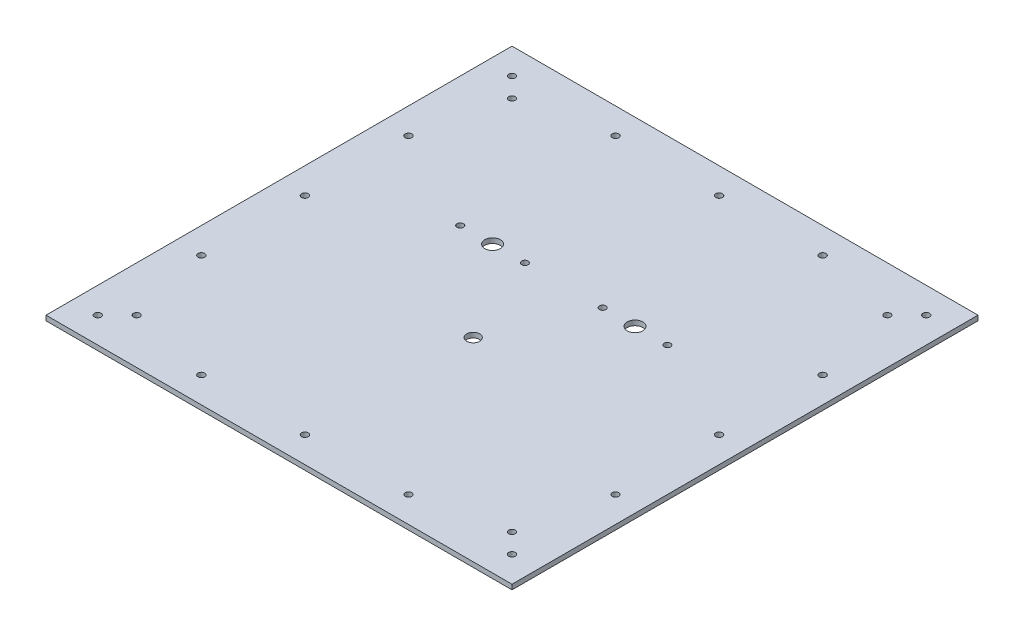
ISO-10303-21;
HEADER;
FILE_DESCRIPTION(('STEP AP214'),'2;1');
FILE_NAME('part.step','',(''),(''),'','','');
FILE_SCHEMA(('AUTOMOTIVE_DESIGN { 1 0 10303 214 1 1 1 1 }'));
ENDSEC;
DATA;
#1=APPLICATION_CONTEXT('core data for automotive mechanical design processes');
#2=APPLICATION_PROTOCOL_DEFINITION('international standard','automotive_design',2000,#1);
#3=PRODUCT_CONTEXT('',#1,'mechanical');
#4=PRODUCT('Part','Part','',(#3));
#5=PRODUCT_RELATED_PRODUCT_CATEGORY('part','',(#4));
#6=PRODUCT_DEFINITION_FORMATION('','',#4);
#7=PRODUCT_DEFINITION_CONTEXT('part definition',#1,'design');
#8=PRODUCT_DEFINITION('design','',#6,#7);
#9=PRODUCT_DEFINITION_SHAPE('','',#8);
#10=(LENGTH_UNIT() NAMED_UNIT(*) SI_UNIT(.MILLI.,.METRE.));
#11=(NAMED_UNIT(*) PLANE_ANGLE_UNIT() SI_UNIT($,.RADIAN.));
#12=(NAMED_UNIT(*) SI_UNIT($,.STERADIAN.) SOLID_ANGLE_UNIT());
#13=UNCERTAINTY_MEASURE_WITH_UNIT(LENGTH_MEASURE(1.E-05),#10,'distance_accuracy_value','');
#14=(GEOMETRIC_REPRESENTATION_CONTEXT(3) GLOBAL_UNCERTAINTY_ASSIGNED_CONTEXT((#13)) GLOBAL_UNIT_ASSIGNED_CONTEXT((#10,
#11,#12)) REPRESENTATION_CONTEXT('',''));
#15=CARTESIAN_POINT('',(0.,0.,0.));
#16=DIRECTION('',(0.,0.,1.));
#17=DIRECTION('',(1.,0.,0.));
#18=AXIS2_PLACEMENT_3D('',#15,#16,#17);
#19=CARTESIAN_POINT('',(228.6,4.826,228.6));
#20=DIRECTION('',(-1.,0.,0.));
#21=DIRECTION('',(0.,0.,1.));
#22=AXIS2_PLACEMENT_3D('',#19,#20,#21);
#23=PLANE('',#22);
#24=DIRECTION('',(0.,0.,-1.));
#25=VECTOR('',#24,1.);
#26=CARTESIAN_POINT('',(228.6,0.,228.6));
#27=LINE('',#26,#25);
#28=CARTESIAN_POINT('',(228.6,0.,228.6));
#29=VERTEX_POINT('',#28);
#30=CARTESIAN_POINT('',(228.6,0.,-228.6));
#31=VERTEX_POINT('',#30);
#32=EDGE_CURVE('E98',#29,#31,#27,.T.);
#33=ORIENTED_EDGE('',*,*,#32,.T.);
#34=DIRECTION('',(0.,-1.,0.));
#35=VECTOR('',#34,1.);
#36=CARTESIAN_POINT('',(228.6,4.826,-228.6));
#37=LINE('',#36,#35);
#38=CARTESIAN_POINT('',(228.6,4.826,-228.6));
#39=VERTEX_POINT('',#38);
#40=EDGE_CURVE('E11',#39,#31,#37,.T.);
#41=ORIENTED_EDGE('',*,*,#40,.F.);
#42=DIRECTION('',(0.,0.,-1.));
#43=VECTOR('',#42,1.);
#44=CARTESIAN_POINT('',(228.6,4.826,228.6));
#45=LINE('',#44,#43);
#46=CARTESIAN_POINT('',(228.6,4.826,228.6));
#47=VERTEX_POINT('',#46);
#48=EDGE_CURVE('E85',#47,#39,#45,.T.);
#49=ORIENTED_EDGE('',*,*,#48,.F.);
#50=DIRECTION('',(0.,-1.,0.));
#51=VECTOR('',#50,1.);
#52=CARTESIAN_POINT('',(228.6,4.826,228.6));
#53=LINE('',#52,#51);
#54=EDGE_CURVE('E94',#47,#29,#53,.T.);
#55=ORIENTED_EDGE('',*,*,#54,.T.);
#56=EDGE_LOOP('',(#33,#41,#49,#55));
#57=FACE_BOUND('',#56,.T.);
#58=ADVANCED_FACE('F32',(#57),#23,.F.);
#59=CARTESIAN_POINT('',(-228.6,4.826,-228.6));
#60=DIRECTION('',(0.,0.,1.));
#61=DIRECTION('',(1.,0.,0.));
#62=AXIS2_PLACEMENT_3D('',#59,#60,#61);
#63=PLANE('',#62);
#64=DIRECTION('',(-1.,0.,0.));
#65=VECTOR('',#64,1.);
#66=CARTESIAN_POINT('',(-228.6,0.,-228.6));
#67=LINE('',#66,#65);
#68=CARTESIAN_POINT('',(-228.6,0.,-228.6));
#69=VERTEX_POINT('',#68);
#70=EDGE_CURVE('E89',#31,#69,#67,.T.);
#71=ORIENTED_EDGE('',*,*,#70,.T.);
#72=DIRECTION('',(0.,-1.,0.));
#73=VECTOR('',#72,1.);
#74=CARTESIAN_POINT('',(-228.6,4.826,-228.6));
#75=LINE('',#74,#73);
#76=CARTESIAN_POINT('',(-228.6,4.826,-228.6));
#77=VERTEX_POINT('',#76);
#78=EDGE_CURVE('E41',#77,#69,#75,.T.);
#79=ORIENTED_EDGE('',*,*,#78,.F.);
#80=DIRECTION('',(-1.,0.,0.));
#81=VECTOR('',#80,1.);
#82=CARTESIAN_POINT('',(-228.6,4.826,-228.6));
#83=LINE('',#82,#81);
#84=EDGE_CURVE('E80',#39,#77,#83,.T.);
#85=ORIENTED_EDGE('',*,*,#84,.F.);
#86=ORIENTED_EDGE('',*,*,#40,.T.);
#87=EDGE_LOOP('',(#71,#79,#85,#86));
#88=FACE_BOUND('',#87,.T.);
#89=ADVANCED_FACE('F88',(#88),#63,.F.);
#90=CARTESIAN_POINT('',(-228.6,4.826,228.6));
#91=DIRECTION('',(1.,0.,0.));
#92=DIRECTION('',(0.,0.,-1.));
#93=AXIS2_PLACEMENT_3D('',#90,#91,#92);
#94=PLANE('',#93);
#95=DIRECTION('',(0.,0.,1.));
#96=VECTOR('',#95,1.);
#97=CARTESIAN_POINT('',(-228.6,0.,228.6));
#98=LINE('',#97,#96);
#99=CARTESIAN_POINT('',(-228.6,0.,228.6));
#100=VERTEX_POINT('',#99);
#101=EDGE_CURVE('E67',#69,#100,#98,.T.);
#102=ORIENTED_EDGE('',*,*,#101,.T.);
#103=DIRECTION('',(0.,-1.,0.));
#104=VECTOR('',#103,1.);
#105=CARTESIAN_POINT('',(-228.6,4.826,228.6));
#106=LINE('',#105,#104);
#107=CARTESIAN_POINT('',(-228.6,4.826,228.6));
#108=VERTEX_POINT('',#107);
#109=EDGE_CURVE('E90',#108,#100,#106,.T.);
#110=ORIENTED_EDGE('',*,*,#109,.F.);
#111=DIRECTION('',(0.,0.,1.));
#112=VECTOR('',#111,1.);
#113=CARTESIAN_POINT('',(-228.6,4.826,228.6));
#114=LINE('',#113,#112);
#115=EDGE_CURVE('E83',#77,#108,#114,.T.);
#116=ORIENTED_EDGE('',*,*,#115,.F.);
#117=ORIENTED_EDGE('',*,*,#78,.T.);
#118=EDGE_LOOP('',(#102,#110,#116,#117));
#119=FACE_BOUND('',#118,.T.);
#120=ADVANCED_FACE('F92',(#119),#94,.F.);
#121=CARTESIAN_POINT('',(-228.6,4.826,228.6));
#122=DIRECTION('',(0.,0.,-1.));
#123=DIRECTION('',(-1.,0.,0.));
#124=AXIS2_PLACEMENT_3D('',#121,#122,#123);
#125=PLANE('',#124);
#126=DIRECTION('',(1.,0.,0.));
#127=VECTOR('',#126,1.);
#128=CARTESIAN_POINT('',(-228.6,0.,228.6));
#129=LINE('',#128,#127);
#130=EDGE_CURVE('E73',#100,#29,#129,.T.);
#131=ORIENTED_EDGE('',*,*,#130,.T.);
#132=ORIENTED_EDGE('',*,*,#54,.F.);
#133=DIRECTION('',(1.,0.,0.));
#134=VECTOR('',#133,1.);
#135=CARTESIAN_POINT('',(-228.6,4.826,228.6));
#136=LINE('',#135,#134);
#137=EDGE_CURVE('E50',#108,#47,#136,.T.);
#138=ORIENTED_EDGE('',*,*,#137,.F.);
#139=ORIENTED_EDGE('',*,*,#109,.T.);
#140=EDGE_LOOP('',(#131,#132,#138,#139));
#141=FACE_BOUND('',#140,.T.);
#142=ADVANCED_FACE('F204',(#141),#125,.F.);
#143=CARTESIAN_POINT('',(0.,4.826,0.));
#144=DIRECTION('',(0.,-1.,0.));
#145=DIRECTION('',(0.,0.,-1.));
#146=AXIS2_PLACEMENT_3D('',#143,#144,#145);
#147=PLANE('',#146);
#148=CARTESIAN_POINT('',(-101.6,4.826,-50.8));
#149=DIRECTION('',(0.,1.,0.));
#150=DIRECTION('',(0.,0.,1.));
#151=AXIS2_PLACEMENT_3D('',#148,#149,#150);
#152=CIRCLE('',#151,3.175);
#153=CARTESIAN_POINT('',(-101.6,4.826,-47.625));
#154=VERTEX_POINT('',#153);
#155=EDGE_CURVE('E519',#154,#154,#152,.T.);
#156=ORIENTED_EDGE('',*,*,#155,.F.);
#157=EDGE_LOOP('',(#156));
#158=FACE_BOUND('',#157,.T.);
#159=CARTESIAN_POINT('',(-38.1,4.826,-50.8));
#160=DIRECTION('',(0.,1.,0.));
#161=DIRECTION('',(0.,0.,1.));
#162=AXIS2_PLACEMENT_3D('',#159,#160,#161);
#163=CIRCLE('',#162,3.175);
#164=CARTESIAN_POINT('',(-38.1,4.826,-47.625));
#165=VERTEX_POINT('',#164);
#166=EDGE_CURVE('E525',#165,#165,#163,.T.);
#167=ORIENTED_EDGE('',*,*,#166,.F.);
#168=EDGE_LOOP('',(#167));
#169=FACE_BOUND('',#168,.T.);
#170=CARTESIAN_POINT('',(38.1,4.826,-50.8));
#171=DIRECTION('',(0.,1.,0.));
#172=DIRECTION('',(0.,0.,1.));
#173=AXIS2_PLACEMENT_3D('',#170,#171,#172);
#174=CIRCLE('',#173,3.175);
#175=CARTESIAN_POINT('',(38.1,4.826,-47.625));
#176=VERTEX_POINT('',#175);
#177=EDGE_CURVE('E533',#176,#176,#174,.T.);
#178=ORIENTED_EDGE('',*,*,#177,.F.);
#179=EDGE_LOOP('',(#178));
#180=FACE_BOUND('',#179,.T.);
#181=CARTESIAN_POINT('',(101.6,4.826,-50.8));
#182=DIRECTION('',(0.,1.,0.));
#183=DIRECTION('',(0.,0.,1.));
#184=AXIS2_PLACEMENT_3D('',#181,#182,#183);
#185=CIRCLE('',#184,3.175);
#186=CARTESIAN_POINT('',(101.6,4.826,-47.625));
#187=VERTEX_POINT('',#186);
#188=EDGE_CURVE('E539',#187,#187,#185,.T.);
#189=ORIENTED_EDGE('',*,*,#188,.F.);
#190=EDGE_LOOP('',(#189));
#191=FACE_BOUND('',#190,.T.);
#192=CARTESIAN_POINT('',(-101.6,4.826,-203.2));
#193=DIRECTION('',(0.,1.,0.));
#194=DIRECTION('',(0.,0.,1.));
#195=AXIS2_PLACEMENT_3D('',#192,#193,#194);
#196=CIRCLE('',#195,3.26389999999998);
#197=CARTESIAN_POINT('',(-101.6,4.826,-199.9361));
#198=VERTEX_POINT('',#197);
#199=EDGE_CURVE('E556',#198,#198,#196,.T.);
#200=ORIENTED_EDGE('',*,*,#199,.F.);
#201=EDGE_LOOP('',(#200));
#202=FACE_BOUND('',#201,.T.);
#203=CARTESIAN_POINT('',(-203.2,4.826,203.200000000003));
#204=DIRECTION('',(0.,1.,0.));
#205=DIRECTION('',(0.,0.,1.));
#206=AXIS2_PLACEMENT_3D('',#203,#204,#205);
#207=CIRCLE('',#206,3.26389999999998);
#208=CARTESIAN_POINT('',(-203.2,4.826,206.463900000003));
#209=VERTEX_POINT('',#208);
#210=EDGE_CURVE('E559',#209,#209,#207,.T.);
#211=ORIENTED_EDGE('',*,*,#210,.F.);
#212=EDGE_LOOP('',(#211));
#213=FACE_BOUND('',#212,.T.);
#214=CARTESIAN_POINT('',(101.6,4.826,-203.2));
#215=DIRECTION('',(0.,1.,0.));
#216=DIRECTION('',(0.,0.,1.));
#217=AXIS2_PLACEMENT_3D('',#214,#215,#216);
#218=CIRCLE('',#217,3.26389999999998);
#219=CARTESIAN_POINT('',(101.6,4.826,-199.9361));
#220=VERTEX_POINT('',#219);
#221=EDGE_CURVE('E550',#220,#220,#218,.T.);
#222=ORIENTED_EDGE('',*,*,#221,.F.);
#223=EDGE_LOOP('',(#222));
#224=FACE_BOUND('',#223,.T.);
#225=CARTESIAN_POINT('',(0.,4.826,-203.2));
#226=DIRECTION('',(0.,1.,0.));
#227=DIRECTION('',(0.,0.,1.));
#228=AXIS2_PLACEMENT_3D('',#225,#226,#227);
#229=CIRCLE('',#228,3.26389999999998);
#230=CARTESIAN_POINT('',(0.,4.826,-199.9361));
#231=VERTEX_POINT('',#230);
#232=EDGE_CURVE('E553',#231,#231,#229,.T.);
#233=ORIENTED_EDGE('',*,*,#232,.F.);
#234=EDGE_LOOP('',(#233));
#235=FACE_BOUND('',#234,.T.);
#236=CARTESIAN_POINT('',(203.199999999999,4.826,-101.6));
#237=DIRECTION('',(0.,1.,0.));
#238=DIRECTION('',(0.,0.,1.));
#239=AXIS2_PLACEMENT_3D('',#236,#237,#238);
#240=CIRCLE('',#239,3.26389999999998);
#241=CARTESIAN_POINT('',(203.199999999999,4.826,-98.3361));
#242=VERTEX_POINT('',#241);
#243=EDGE_CURVE('E566',#242,#242,#240,.T.);
#244=ORIENTED_EDGE('',*,*,#243,.F.);
#245=EDGE_LOOP('',(#244));
#246=FACE_BOUND('',#245,.T.);
#247=CARTESIAN_POINT('',(203.199999999999,4.826,0.));
#248=DIRECTION('',(0.,1.,0.));
#249=DIRECTION('',(0.,0.,1.));
#250=AXIS2_PLACEMENT_3D('',#247,#248,#249);
#251=CIRCLE('',#250,3.26389999999998);
#252=CARTESIAN_POINT('',(203.199999999999,4.826,3.26389999999998));
#253=VERTEX_POINT('',#252);
#254=EDGE_CURVE('E575',#253,#253,#251,.T.);
#255=ORIENTED_EDGE('',*,*,#254,.F.);
#256=EDGE_LOOP('',(#255));
#257=FACE_BOUND('',#256,.T.);
#258=CARTESIAN_POINT('',(203.2,4.826,101.6));
#259=DIRECTION('',(0.,1.,0.));
#260=DIRECTION('',(0.,0.,1.));
#261=AXIS2_PLACEMENT_3D('',#258,#259,#260);
#262=CIRCLE('',#261,3.26389999999998);
#263=CARTESIAN_POINT('',(203.2,4.826,104.8639));
#264=VERTEX_POINT('',#263);
#265=EDGE_CURVE('E578',#264,#264,#262,.T.);
#266=ORIENTED_EDGE('',*,*,#265,.F.);
#267=EDGE_LOOP('',(#266));
#268=FACE_BOUND('',#267,.T.);
#269=CARTESIAN_POINT('',(-203.2,4.826,-203.2));
#270=DIRECTION('',(0.,1.,0.));
#271=DIRECTION('',(0.,0.,1.));
#272=AXIS2_PLACEMENT_3D('',#269,#270,#271);
#273=CIRCLE('',#272,3.26389999999998);
#274=CARTESIAN_POINT('',(-203.2,4.826,-199.9361));
#275=VERTEX_POINT('',#274);
#276=EDGE_CURVE('E581',#275,#275,#273,.T.);
#277=ORIENTED_EDGE('',*,*,#276,.F.);
#278=EDGE_LOOP('',(#277));
#279=FACE_BOUND('',#278,.T.);
#280=CARTESIAN_POINT('',(203.199999999999,4.826,-203.2));
#281=DIRECTION('',(0.,1.,0.));
#282=DIRECTION('',(0.,0.,1.));
#283=AXIS2_PLACEMENT_3D('',#280,#281,#282);
#284=CIRCLE('',#283,3.26389999999998);
#285=CARTESIAN_POINT('',(203.199999999999,4.826,-199.9361));
#286=VERTEX_POINT('',#285);
#287=EDGE_CURVE('E563',#286,#286,#284,.T.);
#288=ORIENTED_EDGE('',*,*,#287,.F.);
#289=EDGE_LOOP('',(#288));
#290=FACE_BOUND('',#289,.T.);
#291=CARTESIAN_POINT('',(101.6,4.826,203.200000000001));
#292=DIRECTION('',(0.,1.,0.));
#293=DIRECTION('',(0.,0.,1.));
#294=AXIS2_PLACEMENT_3D('',#291,#292,#293);
#295=CIRCLE('',#294,3.26389999999998);
#296=CARTESIAN_POINT('',(101.6,4.826,206.463900000001));
#297=VERTEX_POINT('',#296);
#298=EDGE_CURVE('E567',#297,#297,#295,.T.);
#299=ORIENTED_EDGE('',*,*,#298,.F.);
#300=EDGE_LOOP('',(#299));
#301=FACE_BOUND('',#300,.T.);
#302=CARTESIAN_POINT('',(0.,4.826,203.200000000001));
#303=DIRECTION('',(0.,1.,0.));
#304=DIRECTION('',(0.,0.,1.));
#305=AXIS2_PLACEMENT_3D('',#302,#303,#304);
#306=CIRCLE('',#305,3.26389999999998);
#307=CARTESIAN_POINT('',(0.,4.826,206.463900000001));
#308=VERTEX_POINT('',#307);
#309=EDGE_CURVE('E570',#308,#308,#306,.T.);
#310=ORIENTED_EDGE('',*,*,#309,.F.);
#311=EDGE_LOOP('',(#310));
#312=FACE_BOUND('',#311,.T.);
#313=CARTESIAN_POINT('',(-101.6,4.826,203.200000000002));
#314=DIRECTION('',(0.,1.,0.));
#315=DIRECTION('',(0.,0.,1.));
#316=AXIS2_PLACEMENT_3D('',#313,#314,#315);
#317=CIRCLE('',#316,3.26389999999998);
#318=CARTESIAN_POINT('',(-101.6,4.826,206.463900000002));
#319=VERTEX_POINT('',#318);
#320=EDGE_CURVE('E562',#319,#319,#317,.T.);
#321=ORIENTED_EDGE('',*,*,#320,.F.);
#322=EDGE_LOOP('',(#321));
#323=FACE_BOUND('',#322,.T.);
#324=CARTESIAN_POINT('',(-203.199999999997,4.826,101.6));
#325=DIRECTION('',(0.,1.,0.));
#326=DIRECTION('',(0.,0.,1.));
#327=AXIS2_PLACEMENT_3D('',#324,#325,#326);
#328=CIRCLE('',#327,3.26389999999998);
#329=CARTESIAN_POINT('',(-203.199999999997,4.826,104.8639));
#330=VERTEX_POINT('',#329);
#331=EDGE_CURVE('E522',#330,#330,#328,.T.);
#332=ORIENTED_EDGE('',*,*,#331,.F.);
#333=EDGE_LOOP('',(#332));
#334=FACE_BOUND('',#333,.T.);
#335=CARTESIAN_POINT('',(-203.199999999999,4.826,-101.6));
#336=DIRECTION('',(0.,1.,0.));
#337=DIRECTION('',(0.,0.,1.));
#338=AXIS2_PLACEMENT_3D('',#335,#336,#337);
#339=CIRCLE('',#338,3.26389999999998);
#340=CARTESIAN_POINT('',(-203.199999999999,4.826,-98.3361));
#341=VERTEX_POINT('',#340);
#342=EDGE_CURVE('E547',#341,#341,#339,.T.);
#343=ORIENTED_EDGE('',*,*,#342,.F.);
#344=EDGE_LOOP('',(#343));
#345=FACE_BOUND('',#344,.T.);
#346=CARTESIAN_POINT('',(-203.199999999998,4.826,0.));
#347=DIRECTION('',(0.,1.,0.));
#348=DIRECTION('',(0.,0.,1.));
#349=AXIS2_PLACEMENT_3D('',#346,#347,#348);
#350=CIRCLE('',#349,3.26389999999998);
#351=CARTESIAN_POINT('',(-203.199999999998,4.826,3.26389999999998));
#352=VERTEX_POINT('',#351);
#353=EDGE_CURVE('E544',#352,#352,#350,.T.);
#354=ORIENTED_EDGE('',*,*,#353,.F.);
#355=EDGE_LOOP('',(#354));
#356=FACE_BOUND('',#355,.T.);
#357=CARTESIAN_POINT('',(203.2,4.826,203.2));
#358=DIRECTION('',(0.,1.,0.));
#359=DIRECTION('',(0.,0.,1.));
#360=AXIS2_PLACEMENT_3D('',#357,#358,#359);
#361=CIRCLE('',#360,3.26389999999998);
#362=CARTESIAN_POINT('',(203.2,4.826,206.4639));
#363=VERTEX_POINT('',#362);
#364=EDGE_CURVE('E134',#363,#363,#361,.T.);
#365=ORIENTED_EDGE('',*,*,#364,.F.);
#366=EDGE_LOOP('',(#365));
#367=FACE_BOUND('',#366,.T.);
#368=CARTESIAN_POINT('',(-184.15,4.826,184.15));
#369=DIRECTION('',(0.,1.,0.));
#370=DIRECTION('',(0.,0.,1.));
#371=AXIS2_PLACEMENT_3D('',#368,#369,#370);
#372=CIRCLE('',#371,3.175);
#373=CARTESIAN_POINT('',(-184.15,4.826,187.325));
#374=VERTEX_POINT('',#373);
#375=EDGE_CURVE('E177',#374,#374,#372,.T.);
#376=ORIENTED_EDGE('',*,*,#375,.F.);
#377=EDGE_LOOP('',(#376));
#378=FACE_BOUND('',#377,.T.);
#379=CARTESIAN_POINT('',(184.15,4.826,184.15));
#380=DIRECTION('',(0.,1.,0.));
#381=DIRECTION('',(0.,0.,1.));
#382=AXIS2_PLACEMENT_3D('',#379,#380,#381);
#383=CIRCLE('',#382,3.175);
#384=CARTESIAN_POINT('',(184.15,4.826,187.325));
#385=VERTEX_POINT('',#384);
#386=EDGE_CURVE('E181',#385,#385,#383,.T.);
#387=ORIENTED_EDGE('',*,*,#386,.F.);
#388=EDGE_LOOP('',(#387));
#389=FACE_BOUND('',#388,.T.);
#390=CARTESIAN_POINT('',(184.15,4.826,-184.15));
#391=DIRECTION('',(0.,1.,0.));
#392=DIRECTION('',(0.,0.,1.));
#393=AXIS2_PLACEMENT_3D('',#390,#391,#392);
#394=CIRCLE('',#393,3.175);
#395=CARTESIAN_POINT('',(184.15,4.826,-180.975));
#396=VERTEX_POINT('',#395);
#397=EDGE_CURVE('E186',#396,#396,#394,.T.);
#398=ORIENTED_EDGE('',*,*,#397,.F.);
#399=EDGE_LOOP('',(#398));
#400=FACE_BOUND('',#399,.T.);
#401=CARTESIAN_POINT('',(-184.15,4.826,-184.15));
#402=DIRECTION('',(0.,1.,0.));
#403=DIRECTION('',(0.,0.,1.));
#404=AXIS2_PLACEMENT_3D('',#401,#402,#403);
#405=CIRCLE('',#404,3.175);
#406=CARTESIAN_POINT('',(-184.15,4.826,-180.975));
#407=VERTEX_POINT('',#406);
#408=EDGE_CURVE('E120',#407,#407,#405,.T.);
#409=ORIENTED_EDGE('',*,*,#408,.F.);
#410=EDGE_LOOP('',(#409));
#411=FACE_BOUND('',#410,.T.);
#412=CARTESIAN_POINT('',(69.85,4.826,-50.8));
#413=DIRECTION('',(0.,1.,0.));
#414=DIRECTION('',(0.,0.,1.));
#415=AXIS2_PLACEMENT_3D('',#412,#413,#414);
#416=CIRCLE('',#415,7.62);
#417=CARTESIAN_POINT('',(69.85,4.826,-43.18));
#418=VERTEX_POINT('',#417);
#419=EDGE_CURVE('E111',#418,#418,#416,.T.);
#420=ORIENTED_EDGE('',*,*,#419,.F.);
#421=EDGE_LOOP('',(#420));
#422=FACE_BOUND('',#421,.T.);
#423=CARTESIAN_POINT('',(-69.85,4.826,-50.8));
#424=DIRECTION('',(0.,1.,0.));
#425=DIRECTION('',(0.,0.,1.));
#426=AXIS2_PLACEMENT_3D('',#423,#424,#425);
#427=CIRCLE('',#426,7.62);
#428=CARTESIAN_POINT('',(-69.85,4.826,-43.18));
#429=VERTEX_POINT('',#428);
#430=EDGE_CURVE('E194',#429,#429,#427,.T.);
#431=ORIENTED_EDGE('',*,*,#430,.F.);
#432=EDGE_LOOP('',(#431));
#433=FACE_BOUND('',#432,.T.);
#434=CARTESIAN_POINT('',(0.,4.826,38.1));
#435=DIRECTION('',(0.,1.,0.));
#436=DIRECTION('',(0.,0.,1.));
#437=AXIS2_PLACEMENT_3D('',#434,#435,#436);
#438=CIRCLE('',#437,6.35);
#439=CARTESIAN_POINT('',(0.,4.826,44.45));
#440=VERTEX_POINT('',#439);
#441=EDGE_CURVE('E129',#440,#440,#438,.T.);
#442=ORIENTED_EDGE('',*,*,#441,.F.);
#443=EDGE_LOOP('',(#442));
#444=FACE_BOUND('',#443,.T.);
#445=ORIENTED_EDGE('',*,*,#48,.T.);
#446=ORIENTED_EDGE('',*,*,#84,.T.);
#447=ORIENTED_EDGE('',*,*,#115,.T.);
#448=ORIENTED_EDGE('',*,*,#137,.T.);
#449=EDGE_LOOP('',(#445,#446,#447,#448));
#450=FACE_BOUND('',#449,.T.);
#451=ADVANCED_FACE('F81',(#158,#169,#180,#191,#202,#213,#224,#235,#246,#257,#268,#279,#290,#301,
#312,#323,#334,#345,#356,#367,#378,#389,#400,#411,#422,#433,#444,#450),#147,.F.);
#452=CARTESIAN_POINT('',(0.,0.,0.));
#453=DIRECTION('',(0.,-1.,0.));
#454=DIRECTION('',(0.,0.,-1.));
#455=AXIS2_PLACEMENT_3D('',#452,#453,#454);
#456=PLANE('',#455);
#457=CARTESIAN_POINT('',(-101.6,0.,-50.8));
#458=DIRECTION('',(0.,1.,0.));
#459=DIRECTION('',(0.,0.,1.));
#460=AXIS2_PLACEMENT_3D('',#457,#458,#459);
#461=CIRCLE('',#460,3.175);
#462=CARTESIAN_POINT('',(-101.6,0.,-47.625));
#463=VERTEX_POINT('',#462);
#464=EDGE_CURVE('E517',#463,#463,#461,.T.);
#465=ORIENTED_EDGE('',*,*,#464,.T.);
#466=EDGE_LOOP('',(#465));
#467=FACE_BOUND('',#466,.T.);
#468=CARTESIAN_POINT('',(-38.1,0.,-50.8));
#469=DIRECTION('',(0.,1.,0.));
#470=DIRECTION('',(0.,0.,1.));
#471=AXIS2_PLACEMENT_3D('',#468,#469,#470);
#472=CIRCLE('',#471,3.175);
#473=CARTESIAN_POINT('',(-38.1,0.,-47.625));
#474=VERTEX_POINT('',#473);
#475=EDGE_CURVE('E520',#474,#474,#472,.T.);
#476=ORIENTED_EDGE('',*,*,#475,.T.);
#477=EDGE_LOOP('',(#476));
#478=FACE_BOUND('',#477,.T.);
#479=CARTESIAN_POINT('',(38.1,0.,-50.8));
#480=DIRECTION('',(0.,1.,0.));
#481=DIRECTION('',(0.,0.,1.));
#482=AXIS2_PLACEMENT_3D('',#479,#480,#481);
#483=CIRCLE('',#482,3.175);
#484=CARTESIAN_POINT('',(38.1,0.,-47.625));
#485=VERTEX_POINT('',#484);
#486=EDGE_CURVE('E530',#485,#485,#483,.T.);
#487=ORIENTED_EDGE('',*,*,#486,.T.);
#488=EDGE_LOOP('',(#487));
#489=FACE_BOUND('',#488,.T.);
#490=CARTESIAN_POINT('',(101.6,0.,-50.8));
#491=DIRECTION('',(0.,1.,0.));
#492=DIRECTION('',(0.,0.,1.));
#493=AXIS2_PLACEMENT_3D('',#490,#491,#492);
#494=CIRCLE('',#493,3.175);
#495=CARTESIAN_POINT('',(101.6,0.,-47.625));
#496=VERTEX_POINT('',#495);
#497=EDGE_CURVE('E536',#496,#496,#494,.T.);
#498=ORIENTED_EDGE('',*,*,#497,.T.);
#499=EDGE_LOOP('',(#498));
#500=FACE_BOUND('',#499,.T.);
#501=CARTESIAN_POINT('',(-101.6,0.,-203.2));
#502=DIRECTION('',(0.,-1.,0.));
#503=DIRECTION('',(0.,0.,-1.));
#504=AXIS2_PLACEMENT_3D('',#501,#502,#503);
#505=CIRCLE('',#504,3.26389999999998);
#506=CARTESIAN_POINT('',(-101.6,0.,-206.4639));
#507=VERTEX_POINT('',#506);
#508=EDGE_CURVE('E35',#507,#507,#505,.T.);
#509=ORIENTED_EDGE('',*,*,#508,.F.);
#510=EDGE_LOOP('',(#509));
#511=FACE_BOUND('',#510,.T.);
#512=CARTESIAN_POINT('',(-203.2,0.,203.200000000003));
#513=DIRECTION('',(0.,-1.,0.));
#514=DIRECTION('',(0.,0.,-1.));
#515=AXIS2_PLACEMENT_3D('',#512,#513,#514);
#516=CIRCLE('',#515,3.26389999999998);
#517=CARTESIAN_POINT('',(-203.2,0.,199.936100000003));
#518=VERTEX_POINT('',#517);
#519=EDGE_CURVE('E172',#518,#518,#516,.T.);
#520=ORIENTED_EDGE('',*,*,#519,.F.);
#521=EDGE_LOOP('',(#520));
#522=FACE_BOUND('',#521,.T.);
#523=CARTESIAN_POINT('',(101.6,0.,-203.2));
#524=DIRECTION('',(0.,-1.,0.));
#525=DIRECTION('',(0.,0.,-1.));
#526=AXIS2_PLACEMENT_3D('',#523,#524,#525);
#527=CIRCLE('',#526,3.26389999999998);
#528=CARTESIAN_POINT('',(101.6,0.,-206.4639));
#529=VERTEX_POINT('',#528);
#530=EDGE_CURVE('E170',#529,#529,#527,.T.);
#531=ORIENTED_EDGE('',*,*,#530,.F.);
#532=EDGE_LOOP('',(#531));
#533=FACE_BOUND('',#532,.T.);
#534=CARTESIAN_POINT('',(0.,0.,-203.2));
#535=DIRECTION('',(0.,-1.,0.));
#536=DIRECTION('',(0.,0.,-1.));
#537=AXIS2_PLACEMENT_3D('',#534,#535,#536);
#538=CIRCLE('',#537,3.26389999999998);
#539=CARTESIAN_POINT('',(0.,0.,-206.4639));
#540=VERTEX_POINT('',#539);
#541=EDGE_CURVE('E167',#540,#540,#538,.T.);
#542=ORIENTED_EDGE('',*,*,#541,.F.);
#543=EDGE_LOOP('',(#542));
#544=FACE_BOUND('',#543,.T.);
#545=CARTESIAN_POINT('',(203.199999999999,0.,-101.6));
#546=DIRECTION('',(0.,-1.,0.));
#547=DIRECTION('',(0.,0.,-1.));
#548=AXIS2_PLACEMENT_3D('',#545,#546,#547);
#549=CIRCLE('',#548,3.26389999999998);
#550=CARTESIAN_POINT('',(203.199999999999,0.,-104.8639));
#551=VERTEX_POINT('',#550);
#552=EDGE_CURVE('E164',#551,#551,#549,.T.);
#553=ORIENTED_EDGE('',*,*,#552,.F.);
#554=EDGE_LOOP('',(#553));
#555=FACE_BOUND('',#554,.T.);
#556=CARTESIAN_POINT('',(203.199999999999,0.,0.));
#557=DIRECTION('',(0.,-1.,0.));
#558=DIRECTION('',(0.,0.,-1.));
#559=AXIS2_PLACEMENT_3D('',#556,#557,#558);
#560=CIRCLE('',#559,3.26389999999998);
#561=CARTESIAN_POINT('',(203.199999999999,0.,-3.26389999999998));
#562=VERTEX_POINT('',#561);
#563=EDGE_CURVE('E161',#562,#562,#560,.T.);
#564=ORIENTED_EDGE('',*,*,#563,.F.);
#565=EDGE_LOOP('',(#564));
#566=FACE_BOUND('',#565,.T.);
#567=CARTESIAN_POINT('',(203.2,0.,101.6));
#568=DIRECTION('',(0.,-1.,0.));
#569=DIRECTION('',(0.,0.,-1.));
#570=AXIS2_PLACEMENT_3D('',#567,#568,#569);
#571=CIRCLE('',#570,3.26389999999998);
#572=CARTESIAN_POINT('',(203.2,0.,98.3361));
#573=VERTEX_POINT('',#572);
#574=EDGE_CURVE('E158',#573,#573,#571,.T.);
#575=ORIENTED_EDGE('',*,*,#574,.F.);
#576=EDGE_LOOP('',(#575));
#577=FACE_BOUND('',#576,.T.);
#578=CARTESIAN_POINT('',(-203.2,0.,-203.2));
#579=DIRECTION('',(0.,-1.,0.));
#580=DIRECTION('',(0.,0.,-1.));
#581=AXIS2_PLACEMENT_3D('',#578,#579,#580);
#582=CIRCLE('',#581,3.26389999999998);
#583=CARTESIAN_POINT('',(-203.2,0.,-206.4639));
#584=VERTEX_POINT('',#583);
#585=EDGE_CURVE('E155',#584,#584,#582,.T.);
#586=ORIENTED_EDGE('',*,*,#585,.F.);
#587=EDGE_LOOP('',(#586));
#588=FACE_BOUND('',#587,.T.);
#589=CARTESIAN_POINT('',(203.199999999999,0.,-203.2));
#590=DIRECTION('',(0.,-1.,0.));
#591=DIRECTION('',(0.,0.,-1.));
#592=AXIS2_PLACEMENT_3D('',#589,#590,#591);
#593=CIRCLE('',#592,3.26389999999998);
#594=CARTESIAN_POINT('',(203.199999999999,0.,-206.4639));
#595=VERTEX_POINT('',#594);
#596=EDGE_CURVE('E152',#595,#595,#593,.T.);
#597=ORIENTED_EDGE('',*,*,#596,.F.);
#598=EDGE_LOOP('',(#597));
#599=FACE_BOUND('',#598,.T.);
#600=CARTESIAN_POINT('',(101.6,0.,203.200000000001));
#601=DIRECTION('',(0.,-1.,0.));
#602=DIRECTION('',(0.,0.,-1.));
#603=AXIS2_PLACEMENT_3D('',#600,#601,#602);
#604=CIRCLE('',#603,3.26389999999998);
#605=CARTESIAN_POINT('',(101.6,0.,199.936100000001));
#606=VERTEX_POINT('',#605);
#607=EDGE_CURVE('E149',#606,#606,#604,.T.);
#608=ORIENTED_EDGE('',*,*,#607,.F.);
#609=EDGE_LOOP('',(#608));
#610=FACE_BOUND('',#609,.T.);
#611=CARTESIAN_POINT('',(0.,0.,203.200000000001));
#612=DIRECTION('',(0.,-1.,0.));
#613=DIRECTION('',(0.,0.,-1.));
#614=AXIS2_PLACEMENT_3D('',#611,#612,#613);
#615=CIRCLE('',#614,3.26389999999998);
#616=CARTESIAN_POINT('',(0.,0.,199.936100000001));
#617=VERTEX_POINT('',#616);
#618=EDGE_CURVE('E146',#617,#617,#615,.T.);
#619=ORIENTED_EDGE('',*,*,#618,.F.);
#620=EDGE_LOOP('',(#619));
#621=FACE_BOUND('',#620,.T.);
#622=CARTESIAN_POINT('',(-101.6,0.,203.200000000002));
#623=DIRECTION('',(0.,-1.,0.));
#624=DIRECTION('',(0.,0.,-1.));
#625=AXIS2_PLACEMENT_3D('',#622,#623,#624);
#626=CIRCLE('',#625,3.26389999999998);
#627=CARTESIAN_POINT('',(-101.6,0.,199.936100000002));
#628=VERTEX_POINT('',#627);
#629=EDGE_CURVE('E143',#628,#628,#626,.T.);
#630=ORIENTED_EDGE('',*,*,#629,.F.);
#631=EDGE_LOOP('',(#630));
#632=FACE_BOUND('',#631,.T.);
#633=CARTESIAN_POINT('',(-203.199999999997,0.,101.6));
#634=DIRECTION('',(0.,-1.,0.));
#635=DIRECTION('',(0.,0.,-1.));
#636=AXIS2_PLACEMENT_3D('',#633,#634,#635);
#637=CIRCLE('',#636,3.26389999999998);
#638=CARTESIAN_POINT('',(-203.199999999997,0.,98.3361));
#639=VERTEX_POINT('',#638);
#640=EDGE_CURVE('E140',#639,#639,#637,.T.);
#641=ORIENTED_EDGE('',*,*,#640,.F.);
#642=EDGE_LOOP('',(#641));
#643=FACE_BOUND('',#642,.T.);
#644=CARTESIAN_POINT('',(-203.199999999999,0.,-101.6));
#645=DIRECTION('',(0.,-1.,0.));
#646=DIRECTION('',(0.,0.,-1.));
#647=AXIS2_PLACEMENT_3D('',#644,#645,#646);
#648=CIRCLE('',#647,3.26389999999998);
#649=CARTESIAN_POINT('',(-203.199999999999,0.,-104.8639));
#650=VERTEX_POINT('',#649);
#651=EDGE_CURVE('E137',#650,#650,#648,.T.);
#652=ORIENTED_EDGE('',*,*,#651,.F.);
#653=EDGE_LOOP('',(#652));
#654=FACE_BOUND('',#653,.T.);
#655=CARTESIAN_POINT('',(-203.199999999998,0.,0.));
#656=DIRECTION('',(0.,-1.,0.));
#657=DIRECTION('',(0.,0.,-1.));
#658=AXIS2_PLACEMENT_3D('',#655,#656,#657);
#659=CIRCLE('',#658,3.26389999999998);
#660=CARTESIAN_POINT('',(-203.199999999998,0.,-3.26389999999998));
#661=VERTEX_POINT('',#660);
#662=EDGE_CURVE('E133',#661,#661,#659,.T.);
#663=ORIENTED_EDGE('',*,*,#662,.F.);
#664=EDGE_LOOP('',(#663));
#665=FACE_BOUND('',#664,.T.);
#666=CARTESIAN_POINT('',(203.2,0.,203.2));
#667=DIRECTION('',(0.,-1.,0.));
#668=DIRECTION('',(0.,0.,-1.));
#669=AXIS2_PLACEMENT_3D('',#666,#667,#668);
#670=CIRCLE('',#669,3.26389999999998);
#671=CARTESIAN_POINT('',(203.2,0.,199.9361));
#672=VERTEX_POINT('',#671);
#673=EDGE_CURVE('E130',#672,#672,#670,.T.);
#674=ORIENTED_EDGE('',*,*,#673,.F.);
#675=EDGE_LOOP('',(#674));
#676=FACE_BOUND('',#675,.T.);
#677=CARTESIAN_POINT('',(-184.15,0.,184.15));
#678=DIRECTION('',(0.,-1.,0.));
#679=DIRECTION('',(0.,0.,-1.));
#680=AXIS2_PLACEMENT_3D('',#677,#678,#679);
#681=CIRCLE('',#680,3.175);
#682=CARTESIAN_POINT('',(-184.15,0.,180.975));
#683=VERTEX_POINT('',#682);
#684=EDGE_CURVE('E126',#683,#683,#681,.T.);
#685=ORIENTED_EDGE('',*,*,#684,.F.);
#686=EDGE_LOOP('',(#685));
#687=FACE_BOUND('',#686,.T.);
#688=CARTESIAN_POINT('',(184.15,0.,184.15));
#689=DIRECTION('',(0.,-1.,0.));
#690=DIRECTION('',(0.,0.,-1.));
#691=AXIS2_PLACEMENT_3D('',#688,#689,#690);
#692=CIRCLE('',#691,3.175);
#693=CARTESIAN_POINT('',(184.15,0.,180.975));
#694=VERTEX_POINT('',#693);
#695=EDGE_CURVE('E123',#694,#694,#692,.T.);
#696=ORIENTED_EDGE('',*,*,#695,.F.);
#697=EDGE_LOOP('',(#696));
#698=FACE_BOUND('',#697,.T.);
#699=CARTESIAN_POINT('',(184.15,0.,-184.15));
#700=DIRECTION('',(0.,-1.,0.));
#701=DIRECTION('',(0.,0.,-1.));
#702=AXIS2_PLACEMENT_3D('',#699,#700,#701);
#703=CIRCLE('',#702,3.175);
#704=CARTESIAN_POINT('',(184.15,0.,-187.325));
#705=VERTEX_POINT('',#704);
#706=EDGE_CURVE('E119',#705,#705,#703,.T.);
#707=ORIENTED_EDGE('',*,*,#706,.F.);
#708=EDGE_LOOP('',(#707));
#709=FACE_BOUND('',#708,.T.);
#710=CARTESIAN_POINT('',(-184.15,0.,-184.15));
#711=DIRECTION('',(0.,-1.,0.));
#712=DIRECTION('',(0.,0.,-1.));
#713=AXIS2_PLACEMENT_3D('',#710,#711,#712);
#714=CIRCLE('',#713,3.175);
#715=CARTESIAN_POINT('',(-184.15,0.,-187.325));
#716=VERTEX_POINT('',#715);
#717=EDGE_CURVE('E116',#716,#716,#714,.T.);
#718=ORIENTED_EDGE('',*,*,#717,.F.);
#719=EDGE_LOOP('',(#718));
#720=FACE_BOUND('',#719,.T.);
#721=CARTESIAN_POINT('',(69.85,0.,-50.8));
#722=DIRECTION('',(0.,-1.,0.));
#723=DIRECTION('',(0.,0.,-1.));
#724=AXIS2_PLACEMENT_3D('',#721,#722,#723);
#725=CIRCLE('',#724,7.62);
#726=CARTESIAN_POINT('',(69.85,0.,-58.42));
#727=VERTEX_POINT('',#726);
#728=EDGE_CURVE('E101',#727,#727,#725,.T.);
#729=ORIENTED_EDGE('',*,*,#728,.F.);
#730=EDGE_LOOP('',(#729));
#731=FACE_BOUND('',#730,.T.);
#732=CARTESIAN_POINT('',(-69.85,0.,-50.8));
#733=DIRECTION('',(0.,-1.,0.));
#734=DIRECTION('',(0.,0.,-1.));
#735=AXIS2_PLACEMENT_3D('',#732,#733,#734);
#736=CIRCLE('',#735,7.62);
#737=CARTESIAN_POINT('',(-69.85,0.,-58.42));
#738=VERTEX_POINT('',#737);
#739=EDGE_CURVE('E110',#738,#738,#736,.T.);
#740=ORIENTED_EDGE('',*,*,#739,.F.);
#741=EDGE_LOOP('',(#740));
#742=FACE_BOUND('',#741,.T.);
#743=CARTESIAN_POINT('',(0.,0.,38.1));
#744=DIRECTION('',(0.,-1.,0.));
#745=DIRECTION('',(0.,0.,-1.));
#746=AXIS2_PLACEMENT_3D('',#743,#744,#745);
#747=CIRCLE('',#746,6.35);
#748=CARTESIAN_POINT('',(0.,0.,31.75));
#749=VERTEX_POINT('',#748);
#750=EDGE_CURVE('E107',#749,#749,#747,.T.);
#751=ORIENTED_EDGE('',*,*,#750,.F.);
#752=EDGE_LOOP('',(#751));
#753=FACE_BOUND('',#752,.T.);
#754=ORIENTED_EDGE('',*,*,#32,.F.);
#755=ORIENTED_EDGE('',*,*,#130,.F.);
#756=ORIENTED_EDGE('',*,*,#101,.F.);
#757=ORIENTED_EDGE('',*,*,#70,.F.);
#758=EDGE_LOOP('',(#754,#755,#756,#757));
#759=FACE_BOUND('',#758,.T.);
#760=ADVANCED_FACE('F203',(#467,#478,#489,#500,#511,#522,#533,#544,#555,#566,#577,#588,#599,
#610,#621,#632,#643,#654,#665,#676,#687,#698,#709,#720,#731,#742,#753,#759),#456,.T.);
#761=CARTESIAN_POINT('',(0.,-20.574,38.1));
#762=DIRECTION('',(0.,1.,0.));
#763=DIRECTION('',(0.,0.,1.));
#764=AXIS2_PLACEMENT_3D('',#761,#762,#763);
#765=CYLINDRICAL_SURFACE('',#764,6.35);
#766=ORIENTED_EDGE('',*,*,#750,.T.);
#767=EDGE_LOOP('',(#766));
#768=FACE_BOUND('',#767,.T.);
#769=ORIENTED_EDGE('',*,*,#441,.T.);
#770=EDGE_LOOP('',(#769));
#771=FACE_BOUND('',#770,.T.);
#772=ADVANCED_FACE('F200',(#768,#771),#765,.F.);
#773=CARTESIAN_POINT('',(-69.85,-20.574,-50.8));
#774=DIRECTION('',(0.,1.,0.));
#775=DIRECTION('',(0.,0.,1.));
#776=AXIS2_PLACEMENT_3D('',#773,#774,#775);
#777=CYLINDRICAL_SURFACE('',#776,7.62);
#778=ORIENTED_EDGE('',*,*,#739,.T.);
#779=EDGE_LOOP('',(#778));
#780=FACE_BOUND('',#779,.T.);
#781=ORIENTED_EDGE('',*,*,#430,.T.);
#782=EDGE_LOOP('',(#781));
#783=FACE_BOUND('',#782,.T.);
#784=ADVANCED_FACE('F244',(#780,#783),#777,.F.);
#785=CARTESIAN_POINT('',(69.85,-20.574,-50.8));
#786=DIRECTION('',(0.,1.,0.));
#787=DIRECTION('',(0.,0.,1.));
#788=AXIS2_PLACEMENT_3D('',#785,#786,#787);
#789=CYLINDRICAL_SURFACE('',#788,7.62);
#790=ORIENTED_EDGE('',*,*,#728,.T.);
#791=EDGE_LOOP('',(#790));
#792=FACE_BOUND('',#791,.T.);
#793=ORIENTED_EDGE('',*,*,#419,.T.);
#794=EDGE_LOOP('',(#793));
#795=FACE_BOUND('',#794,.T.);
#796=ADVANCED_FACE('F254',(#792,#795),#789,.F.);
#797=CARTESIAN_POINT('',(-184.15,-0.254000000000001,-184.15));
#798=DIRECTION('',(0.,1.,0.));
#799=DIRECTION('',(0.,0.,1.));
#800=AXIS2_PLACEMENT_3D('',#797,#798,#799);
#801=CYLINDRICAL_SURFACE('',#800,3.175);
#802=ORIENTED_EDGE('',*,*,#717,.T.);
#803=EDGE_LOOP('',(#802));
#804=FACE_BOUND('',#803,.T.);
#805=ORIENTED_EDGE('',*,*,#408,.T.);
#806=EDGE_LOOP('',(#805));
#807=FACE_BOUND('',#806,.T.);
#808=ADVANCED_FACE('F264',(#804,#807),#801,.F.);
#809=CARTESIAN_POINT('',(184.15,-0.254000000000001,-184.15));
#810=DIRECTION('',(0.,1.,0.));
#811=DIRECTION('',(0.,0.,1.));
#812=AXIS2_PLACEMENT_3D('',#809,#810,#811);
#813=CYLINDRICAL_SURFACE('',#812,3.175);
#814=ORIENTED_EDGE('',*,*,#706,.T.);
#815=EDGE_LOOP('',(#814));
#816=FACE_BOUND('',#815,.T.);
#817=ORIENTED_EDGE('',*,*,#397,.T.);
#818=EDGE_LOOP('',(#817));
#819=FACE_BOUND('',#818,.T.);
#820=ADVANCED_FACE('F274',(#816,#819),#813,.F.);
#821=CARTESIAN_POINT('',(184.15,-0.254000000000001,184.15));
#822=DIRECTION('',(0.,1.,0.));
#823=DIRECTION('',(0.,0.,1.));
#824=AXIS2_PLACEMENT_3D('',#821,#822,#823);
#825=CYLINDRICAL_SURFACE('',#824,3.175);
#826=ORIENTED_EDGE('',*,*,#695,.T.);
#827=EDGE_LOOP('',(#826));
#828=FACE_BOUND('',#827,.T.);
#829=ORIENTED_EDGE('',*,*,#386,.T.);
#830=EDGE_LOOP('',(#829));
#831=FACE_BOUND('',#830,.T.);
#832=ADVANCED_FACE('F284',(#828,#831),#825,.F.);
#833=CARTESIAN_POINT('',(-184.15,-0.254000000000001,184.15));
#834=DIRECTION('',(0.,1.,0.));
#835=DIRECTION('',(0.,0.,1.));
#836=AXIS2_PLACEMENT_3D('',#833,#834,#835);
#837=CYLINDRICAL_SURFACE('',#836,3.175);
#838=ORIENTED_EDGE('',*,*,#684,.T.);
#839=EDGE_LOOP('',(#838));
#840=FACE_BOUND('',#839,.T.);
#841=ORIENTED_EDGE('',*,*,#375,.T.);
#842=EDGE_LOOP('',(#841));
#843=FACE_BOUND('',#842,.T.);
#844=ADVANCED_FACE('F294',(#840,#843),#837,.F.);
#845=CARTESIAN_POINT('',(203.2,-7.874,203.2));
#846=DIRECTION('',(0.,1.,0.));
#847=DIRECTION('',(0.,0.,1.));
#848=AXIS2_PLACEMENT_3D('',#845,#846,#847);
#849=CYLINDRICAL_SURFACE('',#848,3.26389999999998);
#850=ORIENTED_EDGE('',*,*,#673,.T.);
#851=EDGE_LOOP('',(#850));
#852=FACE_BOUND('',#851,.T.);
#853=ORIENTED_EDGE('',*,*,#364,.T.);
#854=EDGE_LOOP('',(#853));
#855=FACE_BOUND('',#854,.T.);
#856=ADVANCED_FACE('F304',(#852,#855),#849,.F.);
#857=CARTESIAN_POINT('',(-203.199999999998,-7.874,0.));
#858=DIRECTION('',(0.,1.,0.));
#859=DIRECTION('',(0.,0.,1.));
#860=AXIS2_PLACEMENT_3D('',#857,#858,#859);
#861=CYLINDRICAL_SURFACE('',#860,3.26389999999998);
#862=ORIENTED_EDGE('',*,*,#662,.T.);
#863=EDGE_LOOP('',(#862));
#864=FACE_BOUND('',#863,.T.);
#865=ORIENTED_EDGE('',*,*,#353,.T.);
#866=EDGE_LOOP('',(#865));
#867=FACE_BOUND('',#866,.T.);
#868=ADVANCED_FACE('F314',(#864,#867),#861,.F.);
#869=CARTESIAN_POINT('',(-203.199999999999,-7.874,-101.6));
#870=DIRECTION('',(0.,1.,0.));
#871=DIRECTION('',(0.,0.,1.));
#872=AXIS2_PLACEMENT_3D('',#869,#870,#871);
#873=CYLINDRICAL_SURFACE('',#872,3.26389999999998);
#874=ORIENTED_EDGE('',*,*,#651,.T.);
#875=EDGE_LOOP('',(#874));
#876=FACE_BOUND('',#875,.T.);
#877=ORIENTED_EDGE('',*,*,#342,.T.);
#878=EDGE_LOOP('',(#877));
#879=FACE_BOUND('',#878,.T.);
#880=ADVANCED_FACE('F324',(#876,#879),#873,.F.);
#881=CARTESIAN_POINT('',(-203.199999999997,-7.874,101.6));
#882=DIRECTION('',(0.,1.,0.));
#883=DIRECTION('',(0.,0.,1.));
#884=AXIS2_PLACEMENT_3D('',#881,#882,#883);
#885=CYLINDRICAL_SURFACE('',#884,3.26389999999998);
#886=ORIENTED_EDGE('',*,*,#640,.T.);
#887=EDGE_LOOP('',(#886));
#888=FACE_BOUND('',#887,.T.);
#889=ORIENTED_EDGE('',*,*,#331,.T.);
#890=EDGE_LOOP('',(#889));
#891=FACE_BOUND('',#890,.T.);
#892=ADVANCED_FACE('F334',(#888,#891),#885,.F.);
#893=CARTESIAN_POINT('',(-101.6,-7.874,203.200000000002));
#894=DIRECTION('',(0.,1.,0.));
#895=DIRECTION('',(0.,0.,1.));
#896=AXIS2_PLACEMENT_3D('',#893,#894,#895);
#897=CYLINDRICAL_SURFACE('',#896,3.26389999999998);
#898=ORIENTED_EDGE('',*,*,#629,.T.);
#899=EDGE_LOOP('',(#898));
#900=FACE_BOUND('',#899,.T.);
#901=ORIENTED_EDGE('',*,*,#320,.T.);
#902=EDGE_LOOP('',(#901));
#903=FACE_BOUND('',#902,.T.);
#904=ADVANCED_FACE('F344',(#900,#903),#897,.F.);
#905=CARTESIAN_POINT('',(0.,-7.874,203.200000000001));
#906=DIRECTION('',(0.,1.,0.));
#907=DIRECTION('',(0.,0.,1.));
#908=AXIS2_PLACEMENT_3D('',#905,#906,#907);
#909=CYLINDRICAL_SURFACE('',#908,3.26389999999998);
#910=ORIENTED_EDGE('',*,*,#618,.T.);
#911=EDGE_LOOP('',(#910));
#912=FACE_BOUND('',#911,.T.);
#913=ORIENTED_EDGE('',*,*,#309,.T.);
#914=EDGE_LOOP('',(#913));
#915=FACE_BOUND('',#914,.T.);
#916=ADVANCED_FACE('F354',(#912,#915),#909,.F.);
#917=CARTESIAN_POINT('',(101.6,-7.874,203.200000000001));
#918=DIRECTION('',(0.,1.,0.));
#919=DIRECTION('',(0.,0.,1.));
#920=AXIS2_PLACEMENT_3D('',#917,#918,#919);
#921=CYLINDRICAL_SURFACE('',#920,3.26389999999998);
#922=ORIENTED_EDGE('',*,*,#607,.T.);
#923=EDGE_LOOP('',(#922));
#924=FACE_BOUND('',#923,.T.);
#925=ORIENTED_EDGE('',*,*,#298,.T.);
#926=EDGE_LOOP('',(#925));
#927=FACE_BOUND('',#926,.T.);
#928=ADVANCED_FACE('F364',(#924,#927),#921,.F.);
#929=CARTESIAN_POINT('',(203.199999999999,-7.874,-203.2));
#930=DIRECTION('',(0.,1.,0.));
#931=DIRECTION('',(0.,0.,1.));
#932=AXIS2_PLACEMENT_3D('',#929,#930,#931);
#933=CYLINDRICAL_SURFACE('',#932,3.26389999999998);
#934=ORIENTED_EDGE('',*,*,#596,.T.);
#935=EDGE_LOOP('',(#934));
#936=FACE_BOUND('',#935,.T.);
#937=ORIENTED_EDGE('',*,*,#287,.T.);
#938=EDGE_LOOP('',(#937));
#939=FACE_BOUND('',#938,.T.);
#940=ADVANCED_FACE('F374',(#936,#939),#933,.F.);
#941=CARTESIAN_POINT('',(-203.2,-7.874,-203.2));
#942=DIRECTION('',(0.,1.,0.));
#943=DIRECTION('',(0.,0.,1.));
#944=AXIS2_PLACEMENT_3D('',#941,#942,#943);
#945=CYLINDRICAL_SURFACE('',#944,3.26389999999998);
#946=ORIENTED_EDGE('',*,*,#585,.T.);
#947=EDGE_LOOP('',(#946));
#948=FACE_BOUND('',#947,.T.);
#949=ORIENTED_EDGE('',*,*,#276,.T.);
#950=EDGE_LOOP('',(#949));
#951=FACE_BOUND('',#950,.T.);
#952=ADVANCED_FACE('F384',(#948,#951),#945,.F.);
#953=CARTESIAN_POINT('',(203.2,-7.874,101.6));
#954=DIRECTION('',(0.,1.,0.));
#955=DIRECTION('',(0.,0.,1.));
#956=AXIS2_PLACEMENT_3D('',#953,#954,#955);
#957=CYLINDRICAL_SURFACE('',#956,3.26389999999998);
#958=ORIENTED_EDGE('',*,*,#574,.T.);
#959=EDGE_LOOP('',(#958));
#960=FACE_BOUND('',#959,.T.);
#961=ORIENTED_EDGE('',*,*,#265,.T.);
#962=EDGE_LOOP('',(#961));
#963=FACE_BOUND('',#962,.T.);
#964=ADVANCED_FACE('F394',(#960,#963),#957,.F.);
#965=CARTESIAN_POINT('',(203.199999999999,-7.874,0.));
#966=DIRECTION('',(0.,1.,0.));
#967=DIRECTION('',(0.,0.,1.));
#968=AXIS2_PLACEMENT_3D('',#965,#966,#967);
#969=CYLINDRICAL_SURFACE('',#968,3.26389999999998);
#970=ORIENTED_EDGE('',*,*,#563,.T.);
#971=EDGE_LOOP('',(#970));
#972=FACE_BOUND('',#971,.T.);
#973=ORIENTED_EDGE('',*,*,#254,.T.);
#974=EDGE_LOOP('',(#973));
#975=FACE_BOUND('',#974,.T.);
#976=ADVANCED_FACE('F404',(#972,#975),#969,.F.);
#977=CARTESIAN_POINT('',(203.199999999999,-7.874,-101.6));
#978=DIRECTION('',(0.,1.,0.));
#979=DIRECTION('',(0.,0.,1.));
#980=AXIS2_PLACEMENT_3D('',#977,#978,#979);
#981=CYLINDRICAL_SURFACE('',#980,3.26389999999998);
#982=ORIENTED_EDGE('',*,*,#552,.T.);
#983=EDGE_LOOP('',(#982));
#984=FACE_BOUND('',#983,.T.);
#985=ORIENTED_EDGE('',*,*,#243,.T.);
#986=EDGE_LOOP('',(#985));
#987=FACE_BOUND('',#986,.T.);
#988=ADVANCED_FACE('F414',(#984,#987),#981,.F.);
#989=CARTESIAN_POINT('',(0.,-7.874,-203.2));
#990=DIRECTION('',(0.,1.,0.));
#991=DIRECTION('',(0.,0.,1.));
#992=AXIS2_PLACEMENT_3D('',#989,#990,#991);
#993=CYLINDRICAL_SURFACE('',#992,3.26389999999998);
#994=ORIENTED_EDGE('',*,*,#541,.T.);
#995=EDGE_LOOP('',(#994));
#996=FACE_BOUND('',#995,.T.);
#997=ORIENTED_EDGE('',*,*,#232,.T.);
#998=EDGE_LOOP('',(#997));
#999=FACE_BOUND('',#998,.T.);
#1000=ADVANCED_FACE('F424',(#996,#999),#993,.F.);
#1001=CARTESIAN_POINT('',(101.6,-7.874,-203.2));
#1002=DIRECTION('',(0.,1.,0.));
#1003=DIRECTION('',(0.,0.,1.));
#1004=AXIS2_PLACEMENT_3D('',#1001,#1002,#1003);
#1005=CYLINDRICAL_SURFACE('',#1004,3.26389999999998);
#1006=ORIENTED_EDGE('',*,*,#530,.T.);
#1007=EDGE_LOOP('',(#1006));
#1008=FACE_BOUND('',#1007,.T.);
#1009=ORIENTED_EDGE('',*,*,#221,.T.);
#1010=EDGE_LOOP('',(#1009));
#1011=FACE_BOUND('',#1010,.T.);
#1012=ADVANCED_FACE('F434',(#1008,#1011),#1005,.F.);
#1013=CARTESIAN_POINT('',(-203.2,-7.874,203.200000000003));
#1014=DIRECTION('',(0.,1.,0.));
#1015=DIRECTION('',(0.,0.,1.));
#1016=AXIS2_PLACEMENT_3D('',#1013,#1014,#1015);
#1017=CYLINDRICAL_SURFACE('',#1016,3.26389999999998);
#1018=ORIENTED_EDGE('',*,*,#519,.T.);
#1019=EDGE_LOOP('',(#1018));
#1020=FACE_BOUND('',#1019,.T.);
#1021=ORIENTED_EDGE('',*,*,#210,.T.);
#1022=EDGE_LOOP('',(#1021));
#1023=FACE_BOUND('',#1022,.T.);
#1024=ADVANCED_FACE('F444',(#1020,#1023),#1017,.F.);
#1025=CARTESIAN_POINT('',(-101.6,-7.874,-203.2));
#1026=DIRECTION('',(0.,1.,0.));
#1027=DIRECTION('',(0.,0.,1.));
#1028=AXIS2_PLACEMENT_3D('',#1025,#1026,#1027);
#1029=CYLINDRICAL_SURFACE('',#1028,3.26389999999998);
#1030=ORIENTED_EDGE('',*,*,#508,.T.);
#1031=EDGE_LOOP('',(#1030));
#1032=FACE_BOUND('',#1031,.T.);
#1033=ORIENTED_EDGE('',*,*,#199,.T.);
#1034=EDGE_LOOP('',(#1033));
#1035=FACE_BOUND('',#1034,.T.);
#1036=ADVANCED_FACE('F454',(#1032,#1035),#1029,.F.);
#1037=CARTESIAN_POINT('',(101.6,0.,-50.8));
#1038=DIRECTION('',(0.,1.,0.));
#1039=DIRECTION('',(0.,0.,1.));
#1040=AXIS2_PLACEMENT_3D('',#1037,#1038,#1039);
#1041=CYLINDRICAL_SURFACE('',#1040,3.175);
#1042=ORIENTED_EDGE('',*,*,#497,.F.);
#1043=EDGE_LOOP('',(#1042));
#1044=FACE_BOUND('',#1043,.T.);
#1045=ORIENTED_EDGE('',*,*,#188,.T.);
#1046=EDGE_LOOP('',(#1045));
#1047=FACE_BOUND('',#1046,.T.);
#1048=ADVANCED_FACE('F462',(#1044,#1047),#1041,.F.);
#1049=CARTESIAN_POINT('',(38.1,0.,-50.8));
#1050=DIRECTION('',(0.,1.,0.));
#1051=DIRECTION('',(0.,0.,1.));
#1052=AXIS2_PLACEMENT_3D('',#1049,#1050,#1051);
#1053=CYLINDRICAL_SURFACE('',#1052,3.175);
#1054=ORIENTED_EDGE('',*,*,#486,.F.);
#1055=EDGE_LOOP('',(#1054));
#1056=FACE_BOUND('',#1055,.T.);
#1057=ORIENTED_EDGE('',*,*,#177,.T.);
#1058=EDGE_LOOP('',(#1057));
#1059=FACE_BOUND('',#1058,.T.);
#1060=ADVANCED_FACE('F480',(#1056,#1059),#1053,.F.);
#1061=CARTESIAN_POINT('',(-38.1,0.,-50.8));
#1062=DIRECTION('',(0.,1.,0.));
#1063=DIRECTION('',(0.,0.,1.));
#1064=AXIS2_PLACEMENT_3D('',#1061,#1062,#1063);
#1065=CYLINDRICAL_SURFACE('',#1064,3.175);
#1066=ORIENTED_EDGE('',*,*,#475,.F.);
#1067=EDGE_LOOP('',(#1066));
#1068=FACE_BOUND('',#1067,.T.);
#1069=ORIENTED_EDGE('',*,*,#166,.T.);
#1070=EDGE_LOOP('',(#1069));
#1071=FACE_BOUND('',#1070,.T.);
#1072=ADVANCED_FACE('F490',(#1068,#1071),#1065,.F.);
#1073=CARTESIAN_POINT('',(-101.6,0.,-50.8));
#1074=DIRECTION('',(0.,1.,0.));
#1075=DIRECTION('',(0.,0.,1.));
#1076=AXIS2_PLACEMENT_3D('',#1073,#1074,#1075);
#1077=CYLINDRICAL_SURFACE('',#1076,3.175);
#1078=ORIENTED_EDGE('',*,*,#464,.F.);
#1079=EDGE_LOOP('',(#1078));
#1080=FACE_BOUND('',#1079,.T.);
#1081=ORIENTED_EDGE('',*,*,#155,.T.);
#1082=EDGE_LOOP('',(#1081));
#1083=FACE_BOUND('',#1082,.T.);
#1084=ADVANCED_FACE('F500',(#1080,#1083),#1077,.F.);
#1085=CLOSED_SHELL('',(#58,#89,#120,#142,#451,#760,#772,#784,#796,#808,#820,#832,#844,#856,#868,
#880,#892,#904,#916,#928,#940,#952,#964,#976,#988,#1000,#1012,#1024,#1036,#1048,#1060,#1072,#1084));
#1086=MANIFOLD_SOLID_BREP('B2',#1085);
#1087=ADVANCED_BREP_SHAPE_REPRESENTATION('',(#18,#1086),#14);
#1088=SHAPE_DEFINITION_REPRESENTATION(#9,#1087);
ENDSEC;
END-ISO-10303-21;
